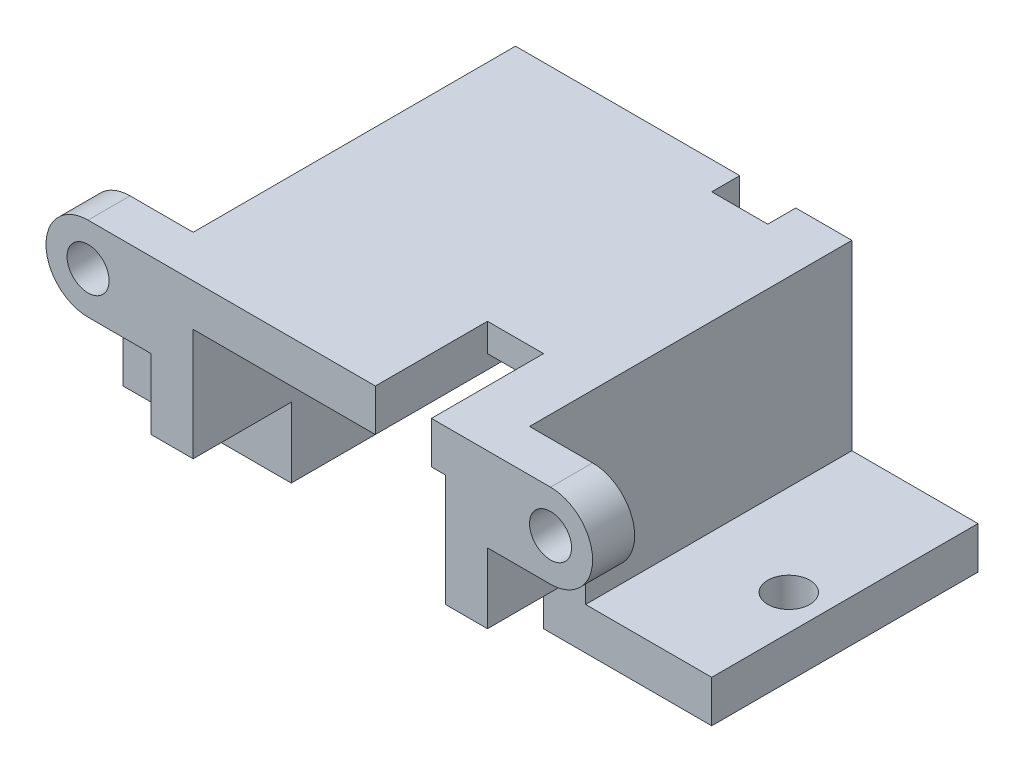
ISO-10303-21;
HEADER;
FILE_DESCRIPTION(('STEP AP214'),'2;1');
FILE_NAME('part.step','',(''),(''),'','','');
FILE_SCHEMA(('AUTOMOTIVE_DESIGN { 1 0 10303 214 1 1 1 1 }'));
ENDSEC;
DATA;
#1=APPLICATION_CONTEXT('core data for automotive mechanical design processes');
#2=APPLICATION_PROTOCOL_DEFINITION('international standard','automotive_design',2000,#1);
#3=PRODUCT_CONTEXT('',#1,'mechanical');
#4=PRODUCT('Part','Part','',(#3));
#5=PRODUCT_RELATED_PRODUCT_CATEGORY('part','',(#4));
#6=PRODUCT_DEFINITION_FORMATION('','',#4);
#7=PRODUCT_DEFINITION_CONTEXT('part definition',#1,'design');
#8=PRODUCT_DEFINITION('design','',#6,#7);
#9=PRODUCT_DEFINITION_SHAPE('','',#8);
#10=(LENGTH_UNIT() NAMED_UNIT(*) SI_UNIT(.MILLI.,.METRE.));
#11=(NAMED_UNIT(*) PLANE_ANGLE_UNIT() SI_UNIT($,.RADIAN.));
#12=(NAMED_UNIT(*) SI_UNIT($,.STERADIAN.) SOLID_ANGLE_UNIT());
#13=UNCERTAINTY_MEASURE_WITH_UNIT(LENGTH_MEASURE(1.E-05),#10,'distance_accuracy_value','');
#14=(GEOMETRIC_REPRESENTATION_CONTEXT(3) GLOBAL_UNCERTAINTY_ASSIGNED_CONTEXT((#13)) GLOBAL_UNIT_ASSIGNED_CONTEXT((#10,
#11,#12)) REPRESENTATION_CONTEXT('',''));
#15=CARTESIAN_POINT('',(0.,0.,0.));
#16=DIRECTION('',(0.,0.,1.));
#17=DIRECTION('',(1.,0.,0.));
#18=AXIS2_PLACEMENT_3D('',#15,#16,#17);
#19=CARTESIAN_POINT('',(-9.,13.,13.));
#20=DIRECTION('',(0.,1.,0.));
#21=DIRECTION('',(0.,0.,1.));
#22=AXIS2_PLACEMENT_3D('',#19,#20,#21);
#23=PLANE('',#22);
#24=DIRECTION('',(0.,0.,1.));
#25=VECTOR('',#24,1.);
#26=CARTESIAN_POINT('',(8.,13.,13.));
#27=LINE('',#26,#25);
#28=CARTESIAN_POINT('',(8.,13.,-13.));
#29=VERTEX_POINT('',#28);
#30=CARTESIAN_POINT('',(8.,13.,13.));
#31=VERTEX_POINT('',#30);
#32=EDGE_CURVE('E478',#29,#31,#27,.T.);
#33=ORIENTED_EDGE('',*,*,#32,.F.);
#34=DIRECTION('',(1.,0.,0.));
#35=VECTOR('',#34,1.);
#36=CARTESIAN_POINT('',(-9.,13.,-13.));
#37=LINE('',#36,#35);
#38=CARTESIAN_POINT('',(9.,13.,-13.));
#39=VERTEX_POINT('',#38);
#40=EDGE_CURVE('E370',#29,#39,#37,.T.);
#41=ORIENTED_EDGE('',*,*,#40,.T.);
#42=DIRECTION('',(0.,0.,-1.));
#43=VECTOR('',#42,1.);
#44=CARTESIAN_POINT('',(9.,13.,13.));
#45=LINE('',#44,#43);
#46=CARTESIAN_POINT('',(9.,13.,13.));
#47=VERTEX_POINT('',#46);
#48=EDGE_CURVE('E377',#47,#39,#45,.T.);
#49=ORIENTED_EDGE('',*,*,#48,.F.);
#50=DIRECTION('',(1.,0.,0.));
#51=VECTOR('',#50,1.);
#52=CARTESIAN_POINT('',(-9.,13.,13.));
#53=LINE('',#52,#51);
#54=EDGE_CURVE('E333',#31,#47,#53,.T.);
#55=ORIENTED_EDGE('',*,*,#54,.F.);
#56=EDGE_LOOP('',(#33,#41,#49,#55));
#57=FACE_BOUND('',#56,.T.);
#58=ADVANCED_FACE('F34',(#57),#23,.F.);
#59=CARTESIAN_POINT('',(-21.,3.,13.));
#60=DIRECTION('',(0.,1.,0.));
#61=DIRECTION('',(0.,0.,1.));
#62=AXIS2_PLACEMENT_3D('',#59,#60,#61);
#63=PLANE('',#62);
#64=DIRECTION('',(-1.,0.,0.));
#65=VECTOR('',#64,1.);
#66=CARTESIAN_POINT('',(-21.,3.,6.));
#67=LINE('',#66,#65);
#68=CARTESIAN_POINT('',(-12.,3.,6.));
#69=VERTEX_POINT('',#68);
#70=CARTESIAN_POINT('',(-21.,3.,6.));
#71=VERTEX_POINT('',#70);
#72=EDGE_CURVE('E452',#69,#71,#67,.T.);
#73=ORIENTED_EDGE('',*,*,#72,.F.);
#74=DIRECTION('',(0.,0.,-1.));
#75=VECTOR('',#74,1.);
#76=CARTESIAN_POINT('',(-12.,3.,13.));
#77=LINE('',#76,#75);
#78=CARTESIAN_POINT('',(-12.,3.,-13.));
#79=VERTEX_POINT('',#78);
#80=EDGE_CURVE('E389',#69,#79,#77,.T.);
#81=ORIENTED_EDGE('',*,*,#80,.T.);
#82=DIRECTION('',(1.,0.,0.));
#83=VECTOR('',#82,1.);
#84=CARTESIAN_POINT('',(-21.,3.,-13.));
#85=LINE('',#84,#83);
#86=CARTESIAN_POINT('',(-21.,3.,-13.));
#87=VERTEX_POINT('',#86);
#88=EDGE_CURVE('E359',#87,#79,#85,.T.);
#89=ORIENTED_EDGE('',*,*,#88,.F.);
#90=DIRECTION('',(0.,0.,-1.));
#91=VECTOR('',#90,1.);
#92=CARTESIAN_POINT('',(-21.,3.,13.));
#93=LINE('',#92,#91);
#94=EDGE_CURVE('E387',#71,#87,#93,.T.);
#95=ORIENTED_EDGE('',*,*,#94,.F.);
#96=EDGE_LOOP('',(#73,#81,#89,#95));
#97=FACE_BOUND('',#96,.T.);
#98=CARTESIAN_POINT('',(-18.5,3.,-2.));
#99=DIRECTION('',(0.,-1.,0.));
#100=DIRECTION('',(0.,0.,1.));
#101=AXIS2_PLACEMENT_3D('',#98,#99,#100);
#102=CIRCLE('',#101,1.5);
#103=CARTESIAN_POINT('',(-18.5,3.,-0.499999999999999));
#104=VERTEX_POINT('',#103);
#105=EDGE_CURVE('E564',#104,#104,#102,.T.);
#106=ORIENTED_EDGE('',*,*,#105,.T.);
#107=EDGE_LOOP('',(#106));
#108=FACE_BOUND('',#107,.T.);
#109=ADVANCED_FACE('F525',(#97,#108),#63,.T.);
#110=CARTESIAN_POINT('',(-21.,0.,13.));
#111=DIRECTION('',(0.,1.,0.));
#112=DIRECTION('',(0.,0.,1.));
#113=AXIS2_PLACEMENT_3D('',#110,#111,#112);
#114=PLANE('',#113);
#115=DIRECTION('',(0.,0.,-1.));
#116=VECTOR('',#115,1.);
#117=CARTESIAN_POINT('',(-9.,0.,13.));
#118=LINE('',#117,#116);
#119=CARTESIAN_POINT('',(-9.,0.,6.));
#120=VERTEX_POINT('',#119);
#121=CARTESIAN_POINT('',(-9.,0.,-13.));
#122=VERTEX_POINT('',#121);
#123=EDGE_CURVE('E383',#120,#122,#118,.T.);
#124=ORIENTED_EDGE('',*,*,#123,.F.);
#125=DIRECTION('',(1.,0.,0.));
#126=VECTOR('',#125,1.);
#127=CARTESIAN_POINT('',(-29.6023252670426,0.,6.));
#128=LINE('',#127,#126);
#129=CARTESIAN_POINT('',(-21.,0.,6.));
#130=VERTEX_POINT('',#129);
#131=EDGE_CURVE('E431',#130,#120,#128,.T.);
#132=ORIENTED_EDGE('',*,*,#131,.F.);
#133=DIRECTION('',(0.,0.,-1.));
#134=VECTOR('',#133,1.);
#135=CARTESIAN_POINT('',(-21.,0.,13.));
#136=LINE('',#135,#134);
#137=CARTESIAN_POINT('',(-21.,0.,-13.));
#138=VERTEX_POINT('',#137);
#139=EDGE_CURVE('E385',#130,#138,#136,.T.);
#140=ORIENTED_EDGE('',*,*,#139,.T.);
#141=DIRECTION('',(1.,0.,0.));
#142=VECTOR('',#141,1.);
#143=CARTESIAN_POINT('',(-21.,0.,-13.));
#144=LINE('',#143,#142);
#145=EDGE_CURVE('E365',#138,#122,#144,.T.);
#146=ORIENTED_EDGE('',*,*,#145,.T.);
#147=EDGE_LOOP('',(#124,#132,#140,#146));
#148=FACE_BOUND('',#147,.T.);
#149=CARTESIAN_POINT('',(-18.5,0.,-2.));
#150=DIRECTION('',(0.,1.,0.));
#151=DIRECTION('',(0.,0.,1.));
#152=AXIS2_PLACEMENT_3D('',#149,#150,#151);
#153=CIRCLE('',#152,1.5);
#154=CARTESIAN_POINT('',(-18.5,0.,-0.499999999999999));
#155=VERTEX_POINT('',#154);
#156=EDGE_CURVE('E561',#155,#155,#153,.T.);
#157=ORIENTED_EDGE('',*,*,#156,.T.);
#158=EDGE_LOOP('',(#157));
#159=FACE_BOUND('',#158,.T.);
#160=ADVANCED_FACE('F531',(#148,#159),#114,.F.);
#161=CARTESIAN_POINT('',(21.,0.,-13.));
#162=DIRECTION('',(0.,0.,-1.));
#163=DIRECTION('',(-1.,0.,0.));
#164=AXIS2_PLACEMENT_3D('',#161,#162,#163);
#165=PLANE('',#164);
#166=DIRECTION('',(0.,1.,0.));
#167=VECTOR('',#166,1.);
#168=CARTESIAN_POINT('',(4.,-0.001000000000001,-13.));
#169=LINE('',#168,#167);
#170=CARTESIAN_POINT('',(4.,13.,-13.));
#171=VERTEX_POINT('',#170);
#172=CARTESIAN_POINT('',(4.,16.,-13.));
#173=VERTEX_POINT('',#172);
#174=EDGE_CURVE('E469',#171,#173,#169,.T.);
#175=ORIENTED_EDGE('',*,*,#174,.F.);
#176=CARTESIAN_POINT('',(-9.,13.,-13.));
#177=VERTEX_POINT('',#176);
#178=EDGE_CURVE('E371',#177,#171,#37,.T.);
#179=ORIENTED_EDGE('',*,*,#178,.F.);
#180=DIRECTION('',(0.,1.,0.));
#181=VECTOR('',#180,1.);
#182=CARTESIAN_POINT('',(-9.,0.,-13.));
#183=LINE('',#182,#181);
#184=EDGE_CURVE('E368',#122,#177,#183,.T.);
#185=ORIENTED_EDGE('',*,*,#184,.F.);
#186=ORIENTED_EDGE('',*,*,#145,.F.);
#187=DIRECTION('',(0.,1.,0.));
#188=VECTOR('',#187,1.);
#189=CARTESIAN_POINT('',(-21.,0.,-13.));
#190=LINE('',#189,#188);
#191=EDGE_CURVE('E362',#138,#87,#190,.T.);
#192=ORIENTED_EDGE('',*,*,#191,.T.);
#193=ORIENTED_EDGE('',*,*,#88,.T.);
#194=DIRECTION('',(0.,1.,0.));
#195=VECTOR('',#194,1.);
#196=CARTESIAN_POINT('',(-12.,0.,-13.));
#197=LINE('',#196,#195);
#198=CARTESIAN_POINT('',(-12.,16.,-13.));
#199=VERTEX_POINT('',#198);
#200=EDGE_CURVE('E356',#79,#199,#197,.T.);
#201=ORIENTED_EDGE('',*,*,#200,.T.);
#202=DIRECTION('',(1.,0.,0.));
#203=VECTOR('',#202,1.);
#204=CARTESIAN_POINT('',(-9.,16.,-13.));
#205=LINE('',#204,#203);
#206=EDGE_CURVE('E353',#199,#173,#205,.T.);
#207=ORIENTED_EDGE('',*,*,#206,.T.);
#208=EDGE_LOOP('',(#175,#179,#185,#186,#192,#193,#201,#207));
#209=FACE_BOUND('',#208,.T.);
#210=ADVANCED_FACE('F550',(#209),#165,.T.);
#211=CARTESIAN_POINT('',(21.,0.,13.));
#212=DIRECTION('',(0.,0.,-1.));
#213=DIRECTION('',(-1.,0.,0.));
#214=AXIS2_PLACEMENT_3D('',#211,#212,#213);
#215=PLANE('',#214);
#216=CARTESIAN_POINT('',(16.5,13.,13.));
#217=DIRECTION('',(0.,0.,-1.));
#218=DIRECTION('',(-1.,0.,0.));
#219=AXIS2_PLACEMENT_3D('',#216,#217,#218);
#220=CIRCLE('',#219,1.5);
#221=CARTESIAN_POINT('',(15.,13.,13.));
#222=VERTEX_POINT('',#221);
#223=EDGE_CURVE('E258',#222,#222,#220,.T.);
#224=ORIENTED_EDGE('',*,*,#223,.T.);
#225=EDGE_LOOP('',(#224));
#226=FACE_BOUND('',#225,.T.);
#227=DIRECTION('',(0.,-1.,0.));
#228=VECTOR('',#227,1.);
#229=CARTESIAN_POINT('',(9.,13.,13.));
#230=LINE('',#229,#228);
#231=CARTESIAN_POINT('',(9.,5.,13.));
#232=VERTEX_POINT('',#231);
#233=EDGE_CURVE('E337',#47,#232,#230,.T.);
#234=ORIENTED_EDGE('',*,*,#233,.T.);
#235=DIRECTION('',(1.,0.,0.));
#236=VECTOR('',#235,1.);
#237=CARTESIAN_POINT('',(-29.6023252670426,5.,13.));
#238=LINE('',#237,#236);
#239=CARTESIAN_POINT('',(12.,5.,13.));
#240=VERTEX_POINT('',#239);
#241=EDGE_CURVE('E412',#232,#240,#238,.T.);
#242=ORIENTED_EDGE('',*,*,#241,.T.);
#243=DIRECTION('',(0.,-1.,0.));
#244=VECTOR('',#243,1.);
#245=CARTESIAN_POINT('',(12.,13.,13.));
#246=LINE('',#245,#244);
#247=CARTESIAN_POINT('',(12.,10.,13.));
#248=VERTEX_POINT('',#247);
#249=EDGE_CURVE('E321',#248,#240,#246,.T.);
#250=ORIENTED_EDGE('',*,*,#249,.F.);
#251=DIRECTION('',(-1.,0.,0.));
#252=VECTOR('',#251,1.);
#253=CARTESIAN_POINT('',(16.5,10.,13.));
#254=LINE('',#253,#252);
#255=CARTESIAN_POINT('',(16.5,10.,13.));
#256=VERTEX_POINT('',#255);
#257=EDGE_CURVE('E265',#256,#248,#254,.T.);
#258=ORIENTED_EDGE('',*,*,#257,.F.);
#259=CARTESIAN_POINT('',(16.5,13.,13.));
#260=DIRECTION('',(0.,0.,-1.));
#261=DIRECTION('',(1.,0.,0.));
#262=AXIS2_PLACEMENT_3D('',#259,#260,#261);
#263=CIRCLE('',#262,3.);
#264=CARTESIAN_POINT('',(16.5,16.,13.));
#265=VERTEX_POINT('',#264);
#266=EDGE_CURVE('E270',#265,#256,#263,.T.);
#267=ORIENTED_EDGE('',*,*,#266,.F.);
#268=DIRECTION('',(1.,0.,0.));
#269=VECTOR('',#268,1.);
#270=CARTESIAN_POINT('',(-9.,16.,13.));
#271=LINE('',#270,#269);
#272=CARTESIAN_POINT('',(8.,16.,13.));
#273=VERTEX_POINT('',#272);
#274=EDGE_CURVE('E324',#273,#265,#271,.T.);
#275=ORIENTED_EDGE('',*,*,#274,.F.);
#276=DIRECTION('',(0.,1.,0.));
#277=VECTOR('',#276,1.);
#278=CARTESIAN_POINT('',(8.,-0.001000000000001,13.));
#279=LINE('',#278,#277);
#280=EDGE_CURVE('E262',#31,#273,#279,.T.);
#281=ORIENTED_EDGE('',*,*,#280,.F.);
#282=ORIENTED_EDGE('',*,*,#54,.T.);
#283=EDGE_LOOP('',(#234,#242,#250,#258,#267,#275,#281,#282));
#284=FACE_BOUND('',#283,.T.);
#285=ADVANCED_FACE('F411',(#226,#284),#215,.F.);
#286=DIRECTION('',(0.,1.,0.));
#287=VECTOR('',#286,1.);
#288=CARTESIAN_POINT('',(-12.,0.,13.));
#289=LINE('',#288,#287);
#290=CARTESIAN_POINT('',(-12.,5.,13.));
#291=VERTEX_POINT('',#290);
#292=CARTESIAN_POINT('',(-12.,10.,13.));
#293=VERTEX_POINT('',#292);
#294=EDGE_CURVE('E329',#291,#293,#289,.T.);
#295=ORIENTED_EDGE('',*,*,#294,.F.);
#296=CARTESIAN_POINT('',(-9.,5.,13.));
#297=VERTEX_POINT('',#296);
#298=EDGE_CURVE('E445',#291,#297,#238,.T.);
#299=ORIENTED_EDGE('',*,*,#298,.T.);
#300=DIRECTION('',(0.,1.,0.));
#301=VECTOR('',#300,1.);
#302=CARTESIAN_POINT('',(-9.,0.,13.));
#303=LINE('',#302,#301);
#304=CARTESIAN_POINT('',(-9.,13.,13.));
#305=VERTEX_POINT('',#304);
#306=EDGE_CURVE('E331',#297,#305,#303,.T.);
#307=ORIENTED_EDGE('',*,*,#306,.T.);
#308=CARTESIAN_POINT('',(4.,13.,13.));
#309=VERTEX_POINT('',#308);
#310=EDGE_CURVE('E334',#305,#309,#53,.T.);
#311=ORIENTED_EDGE('',*,*,#310,.T.);
#312=DIRECTION('',(0.,1.,0.));
#313=VECTOR('',#312,1.);
#314=CARTESIAN_POINT('',(4.,-0.001000000000001,13.));
#315=LINE('',#314,#313);
#316=CARTESIAN_POINT('',(4.,16.,13.));
#317=VERTEX_POINT('',#316);
#318=EDGE_CURVE('E252',#309,#317,#315,.T.);
#319=ORIENTED_EDGE('',*,*,#318,.T.);
#320=CARTESIAN_POINT('',(-16.5,16.,13.));
#321=VERTEX_POINT('',#320);
#322=EDGE_CURVE('E326',#321,#317,#271,.T.);
#323=ORIENTED_EDGE('',*,*,#322,.F.);
#324=CARTESIAN_POINT('',(-16.5,13.,13.));
#325=DIRECTION('',(0.,0.,1.));
#326=DIRECTION('',(-1.,0.,0.));
#327=AXIS2_PLACEMENT_3D('',#324,#325,#326);
#328=CIRCLE('',#327,3.);
#329=CARTESIAN_POINT('',(-16.5,10.,13.));
#330=VERTEX_POINT('',#329);
#331=EDGE_CURVE('E293',#321,#330,#328,.T.);
#332=ORIENTED_EDGE('',*,*,#331,.T.);
#333=DIRECTION('',(1.,0.,0.));
#334=VECTOR('',#333,1.);
#335=CARTESIAN_POINT('',(-16.5,10.,13.));
#336=LINE('',#335,#334);
#337=EDGE_CURVE('E299',#330,#293,#336,.T.);
#338=ORIENTED_EDGE('',*,*,#337,.T.);
#339=EDGE_LOOP('',(#295,#299,#307,#311,#319,#323,#332,#338));
#340=FACE_BOUND('',#339,.T.);
#341=CARTESIAN_POINT('',(-16.5,13.,13.));
#342=DIRECTION('',(0.,0.,1.));
#343=DIRECTION('',(1.,0.,0.));
#344=AXIS2_PLACEMENT_3D('',#341,#342,#343);
#345=CIRCLE('',#344,1.5);
#346=CARTESIAN_POINT('',(-15.,13.,13.));
#347=VERTEX_POINT('',#346);
#348=EDGE_CURVE('E290',#347,#347,#345,.T.);
#349=ORIENTED_EDGE('',*,*,#348,.F.);
#350=EDGE_LOOP('',(#349));
#351=FACE_BOUND('',#350,.T.);
#352=ADVANCED_FACE('F485',(#340,#351),#215,.F.);
#353=CARTESIAN_POINT('',(16.5,13.,10.));
#354=DIRECTION('',(0.,0.,-1.));
#355=DIRECTION('',(1.,0.,0.));
#356=AXIS2_PLACEMENT_3D('',#353,#354,#355);
#357=PLANE('',#356);
#358=DIRECTION('',(0.,1.,0.));
#359=VECTOR('',#358,1.);
#360=CARTESIAN_POINT('',(12.,10.,10.));
#361=LINE('',#360,#359);
#362=CARTESIAN_POINT('',(12.,10.,10.));
#363=VERTEX_POINT('',#362);
#364=CARTESIAN_POINT('',(12.,16.,10.));
#365=VERTEX_POINT('',#364);
#366=EDGE_CURVE('E266',#363,#365,#361,.T.);
#367=ORIENTED_EDGE('',*,*,#366,.T.);
#368=DIRECTION('',(1.,0.,0.));
#369=VECTOR('',#368,1.);
#370=CARTESIAN_POINT('',(12.,16.,10.));
#371=LINE('',#370,#369);
#372=CARTESIAN_POINT('',(16.5,16.,10.));
#373=VERTEX_POINT('',#372);
#374=EDGE_CURVE('E275',#365,#373,#371,.T.);
#375=ORIENTED_EDGE('',*,*,#374,.T.);
#376=CARTESIAN_POINT('',(16.5,13.,10.));
#377=DIRECTION('',(0.,0.,-1.));
#378=DIRECTION('',(1.,0.,0.));
#379=AXIS2_PLACEMENT_3D('',#376,#377,#378);
#380=CIRCLE('',#379,3.);
#381=CARTESIAN_POINT('',(16.5,10.,10.));
#382=VERTEX_POINT('',#381);
#383=EDGE_CURVE('E273',#373,#382,#380,.T.);
#384=ORIENTED_EDGE('',*,*,#383,.T.);
#385=DIRECTION('',(-1.,0.,0.));
#386=VECTOR('',#385,1.);
#387=CARTESIAN_POINT('',(16.5,10.,10.));
#388=LINE('',#387,#386);
#389=EDGE_CURVE('E269',#382,#363,#388,.T.);
#390=ORIENTED_EDGE('',*,*,#389,.T.);
#391=EDGE_LOOP('',(#367,#375,#384,#390));
#392=FACE_BOUND('',#391,.T.);
#393=CARTESIAN_POINT('',(16.5,13.,10.));
#394=DIRECTION('',(0.,0.,-1.));
#395=DIRECTION('',(-1.,0.,0.));
#396=AXIS2_PLACEMENT_3D('',#393,#394,#395);
#397=CIRCLE('',#396,1.5);
#398=CARTESIAN_POINT('',(15.,13.,10.));
#399=VERTEX_POINT('',#398);
#400=EDGE_CURVE('E261',#399,#399,#397,.T.);
#401=ORIENTED_EDGE('',*,*,#400,.F.);
#402=EDGE_LOOP('',(#401));
#403=FACE_BOUND('',#402,.T.);
#404=ADVANCED_FACE('F595',(#392,#403),#357,.T.);
#405=CARTESIAN_POINT('',(12.,13.,13.));
#406=DIRECTION('',(1.,0.,0.));
#407=DIRECTION('',(0.,1.,0.));
#408=AXIS2_PLACEMENT_3D('',#405,#406,#407);
#409=PLANE('',#408);
#410=DIRECTION('',(0.,1.,0.));
#411=VECTOR('',#410,1.);
#412=CARTESIAN_POINT('',(12.,13.,6.));
#413=LINE('',#412,#411);
#414=CARTESIAN_POINT('',(12.,3.,6.));
#415=VERTEX_POINT('',#414);
#416=CARTESIAN_POINT('',(12.,5.,6.));
#417=VERTEX_POINT('',#416);
#418=EDGE_CURVE('E458',#415,#417,#413,.T.);
#419=ORIENTED_EDGE('',*,*,#418,.F.);
#420=DIRECTION('',(0.,0.,-1.));
#421=VECTOR('',#420,1.);
#422=CARTESIAN_POINT('',(12.,3.,13.));
#423=LINE('',#422,#421);
#424=CARTESIAN_POINT('',(12.,3.,-13.));
#425=VERTEX_POINT('',#424);
#426=EDGE_CURVE('E396',#415,#425,#423,.T.);
#427=ORIENTED_EDGE('',*,*,#426,.T.);
#428=DIRECTION('',(0.,-1.,0.));
#429=VECTOR('',#428,1.);
#430=CARTESIAN_POINT('',(12.,13.,-13.));
#431=LINE('',#430,#429);
#432=CARTESIAN_POINT('',(12.,16.,-13.));
#433=VERTEX_POINT('',#432);
#434=EDGE_CURVE('E349',#433,#425,#431,.T.);
#435=ORIENTED_EDGE('',*,*,#434,.F.);
#436=DIRECTION('',(0.,0.,-1.));
#437=VECTOR('',#436,1.);
#438=CARTESIAN_POINT('',(12.,16.,13.));
#439=LINE('',#438,#437);
#440=EDGE_CURVE('E393',#365,#433,#439,.T.);
#441=ORIENTED_EDGE('',*,*,#440,.F.);
#442=ORIENTED_EDGE('',*,*,#366,.F.);
#443=DIRECTION('',(0.,0.,1.));
#444=VECTOR('',#443,1.);
#445=CARTESIAN_POINT('',(12.,10.,10.));
#446=LINE('',#445,#444);
#447=EDGE_CURVE('E277',#363,#248,#446,.T.);
#448=ORIENTED_EDGE('',*,*,#447,.T.);
#449=ORIENTED_EDGE('',*,*,#249,.T.);
#450=DIRECTION('',(0.,0.,1.));
#451=VECTOR('',#450,1.);
#452=CARTESIAN_POINT('',(12.,5.,13.));
#453=LINE('',#452,#451);
#454=EDGE_CURVE('E447',#417,#240,#453,.T.);
#455=ORIENTED_EDGE('',*,*,#454,.F.);
#456=EDGE_LOOP('',(#419,#427,#435,#441,#442,#448,#449,#455));
#457=FACE_BOUND('',#456,.T.);
#458=ADVANCED_FACE('F580',(#457),#409,.T.);
#459=CARTESIAN_POINT('',(9.,0.,13.));
#460=DIRECTION('',(0.,1.,0.));
#461=DIRECTION('',(0.,0.,1.));
#462=AXIS2_PLACEMENT_3D('',#459,#460,#461);
#463=PLANE('',#462);
#464=CARTESIAN_POINT('',(18.5,0.,-2.));
#465=DIRECTION('',(0.,1.,0.));
#466=DIRECTION('',(0.,0.,1.));
#467=AXIS2_PLACEMENT_3D('',#464,#465,#466);
#468=CIRCLE('',#467,1.5);
#469=CARTESIAN_POINT('',(18.5,0.,-0.499999999999999));
#470=VERTEX_POINT('',#469);
#471=EDGE_CURVE('E435',#470,#470,#468,.F.);
#472=ORIENTED_EDGE('',*,*,#471,.F.);
#473=EDGE_LOOP('',(#472));
#474=FACE_BOUND('',#473,.T.);
#475=DIRECTION('',(0.,0.,-1.));
#476=VECTOR('',#475,1.);
#477=CARTESIAN_POINT('',(21.,0.,13.));
#478=LINE('',#477,#476);
#479=CARTESIAN_POINT('',(21.,0.,6.));
#480=VERTEX_POINT('',#479);
#481=CARTESIAN_POINT('',(21.,0.,-13.));
#482=VERTEX_POINT('',#481);
#483=EDGE_CURVE('E400',#480,#482,#478,.T.);
#484=ORIENTED_EDGE('',*,*,#483,.F.);
#485=CARTESIAN_POINT('',(9.,0.,6.));
#486=VERTEX_POINT('',#485);
#487=EDGE_CURVE('E428',#486,#480,#128,.T.);
#488=ORIENTED_EDGE('',*,*,#487,.F.);
#489=DIRECTION('',(0.,0.,-1.));
#490=VECTOR('',#489,1.);
#491=CARTESIAN_POINT('',(9.,0.,13.));
#492=LINE('',#491,#490);
#493=CARTESIAN_POINT('',(9.,0.,-13.));
#494=VERTEX_POINT('',#493);
#495=EDGE_CURVE('E340',#486,#494,#492,.T.);
#496=ORIENTED_EDGE('',*,*,#495,.T.);
#497=DIRECTION('',(1.,0.,0.));
#498=VECTOR('',#497,1.);
#499=CARTESIAN_POINT('',(9.,0.,-13.));
#500=LINE('',#499,#498);
#501=EDGE_CURVE('E316',#494,#482,#500,.T.);
#502=ORIENTED_EDGE('',*,*,#501,.T.);
#503=EDGE_LOOP('',(#484,#488,#496,#502));
#504=FACE_BOUND('',#503,.T.);
#505=ADVANCED_FACE('F36',(#474,#504),#463,.F.);
#506=CARTESIAN_POINT('',(21.,3.,13.));
#507=DIRECTION('',(1.,0.,0.));
#508=DIRECTION('',(0.,0.,-1.));
#509=AXIS2_PLACEMENT_3D('',#506,#507,#508);
#510=PLANE('',#509);
#511=DIRECTION('',(0.,1.,0.));
#512=VECTOR('',#511,1.);
#513=CARTESIAN_POINT('',(21.,0.,6.));
#514=LINE('',#513,#512);
#515=CARTESIAN_POINT('',(21.,3.,6.));
#516=VERTEX_POINT('',#515);
#517=EDGE_CURVE('E432',#480,#516,#514,.T.);
#518=ORIENTED_EDGE('',*,*,#517,.F.);
#519=ORIENTED_EDGE('',*,*,#483,.T.);
#520=DIRECTION('',(0.,-1.,0.));
#521=VECTOR('',#520,1.);
#522=CARTESIAN_POINT('',(21.,3.,-13.));
#523=LINE('',#522,#521);
#524=CARTESIAN_POINT('',(21.,3.,-13.));
#525=VERTEX_POINT('',#524);
#526=EDGE_CURVE('E343',#525,#482,#523,.T.);
#527=ORIENTED_EDGE('',*,*,#526,.F.);
#528=DIRECTION('',(0.,0.,-1.));
#529=VECTOR('',#528,1.);
#530=CARTESIAN_POINT('',(21.,3.,13.));
#531=LINE('',#530,#529);
#532=EDGE_CURVE('E398',#516,#525,#531,.T.);
#533=ORIENTED_EDGE('',*,*,#532,.F.);
#534=EDGE_LOOP('',(#518,#519,#527,#533));
#535=FACE_BOUND('',#534,.T.);
#536=ADVANCED_FACE('F604',(#535),#510,.T.);
#537=CARTESIAN_POINT('',(9.,3.,13.));
#538=DIRECTION('',(0.,1.,0.));
#539=DIRECTION('',(0.,0.,1.));
#540=AXIS2_PLACEMENT_3D('',#537,#538,#539);
#541=PLANE('',#540);
#542=CARTESIAN_POINT('',(18.5,3.,-2.));
#543=DIRECTION('',(0.,1.,0.));
#544=DIRECTION('',(0.,0.,1.));
#545=AXIS2_PLACEMENT_3D('',#542,#543,#544);
#546=CIRCLE('',#545,1.5);
#547=CARTESIAN_POINT('',(18.5,3.,-0.499999999999999));
#548=VERTEX_POINT('',#547);
#549=EDGE_CURVE('E567',#548,#548,#546,.T.);
#550=ORIENTED_EDGE('',*,*,#549,.F.);
#551=EDGE_LOOP('',(#550));
#552=FACE_BOUND('',#551,.T.);
#553=DIRECTION('',(-1.,0.,0.));
#554=VECTOR('',#553,1.);
#555=CARTESIAN_POINT('',(9.,3.,6.));
#556=LINE('',#555,#554);
#557=EDGE_CURVE('E456',#516,#415,#556,.T.);
#558=ORIENTED_EDGE('',*,*,#557,.F.);
#559=ORIENTED_EDGE('',*,*,#532,.T.);
#560=DIRECTION('',(1.,0.,0.));
#561=VECTOR('',#560,1.);
#562=CARTESIAN_POINT('',(9.,3.,-13.));
#563=LINE('',#562,#561);
#564=EDGE_CURVE('E346',#425,#525,#563,.T.);
#565=ORIENTED_EDGE('',*,*,#564,.F.);
#566=ORIENTED_EDGE('',*,*,#426,.F.);
#567=EDGE_LOOP('',(#558,#559,#565,#566));
#568=FACE_BOUND('',#567,.T.);
#569=ADVANCED_FACE('F601',(#552,#568),#541,.T.);
#570=CARTESIAN_POINT('',(-9.,16.,13.));
#571=DIRECTION('',(0.,1.,0.));
#572=DIRECTION('',(0.,0.,1.));
#573=AXIS2_PLACEMENT_3D('',#570,#571,#572);
#574=PLANE('',#573);
#575=DIRECTION('',(0.,0.,1.));
#576=VECTOR('',#575,1.);
#577=CARTESIAN_POINT('',(4.,16.,-13.));
#578=LINE('',#577,#576);
#579=CARTESIAN_POINT('',(4.,16.,-11.));
#580=VERTEX_POINT('',#579);
#581=EDGE_CURVE('E460',#173,#580,#578,.T.);
#582=ORIENTED_EDGE('',*,*,#581,.F.);
#583=ORIENTED_EDGE('',*,*,#206,.F.);
#584=DIRECTION('',(0.,0.,-1.));
#585=VECTOR('',#584,1.);
#586=CARTESIAN_POINT('',(-12.,16.,13.));
#587=LINE('',#586,#585);
#588=CARTESIAN_POINT('',(-12.,16.,10.));
#589=VERTEX_POINT('',#588);
#590=EDGE_CURVE('E391',#589,#199,#587,.T.);
#591=ORIENTED_EDGE('',*,*,#590,.F.);
#592=DIRECTION('',(-1.,0.,0.));
#593=VECTOR('',#592,1.);
#594=CARTESIAN_POINT('',(-12.,16.,10.));
#595=LINE('',#594,#593);
#596=CARTESIAN_POINT('',(-16.5,16.,10.));
#597=VERTEX_POINT('',#596);
#598=EDGE_CURVE('E298',#589,#597,#595,.T.);
#599=ORIENTED_EDGE('',*,*,#598,.T.);
#600=DIRECTION('',(0.,0.,1.));
#601=VECTOR('',#600,1.);
#602=CARTESIAN_POINT('',(-16.5,16.,10.));
#603=LINE('',#602,#601);
#604=EDGE_CURVE('E308',#597,#321,#603,.T.);
#605=ORIENTED_EDGE('',*,*,#604,.T.);
#606=ORIENTED_EDGE('',*,*,#322,.T.);
#607=DIRECTION('',(0.,0.,1.));
#608=VECTOR('',#607,1.);
#609=CARTESIAN_POINT('',(4.,16.,13.));
#610=LINE('',#609,#608);
#611=CARTESIAN_POINT('',(4.,16.,5.));
#612=VERTEX_POINT('',#611);
#613=EDGE_CURVE('E250',#612,#317,#610,.T.);
#614=ORIENTED_EDGE('',*,*,#613,.F.);
#615=DIRECTION('',(-1.,0.,0.));
#616=VECTOR('',#615,1.);
#617=CARTESIAN_POINT('',(8.,16.,5.));
#618=LINE('',#617,#616);
#619=CARTESIAN_POINT('',(8.,16.,5.));
#620=VERTEX_POINT('',#619);
#621=EDGE_CURVE('E254',#620,#612,#618,.T.);
#622=ORIENTED_EDGE('',*,*,#621,.F.);
#623=DIRECTION('',(0.,0.,-1.));
#624=VECTOR('',#623,1.);
#625=CARTESIAN_POINT('',(8.,16.,13.));
#626=LINE('',#625,#624);
#627=EDGE_CURVE('E248',#273,#620,#626,.T.);
#628=ORIENTED_EDGE('',*,*,#627,.F.);
#629=ORIENTED_EDGE('',*,*,#274,.T.);
#630=DIRECTION('',(0.,0.,1.));
#631=VECTOR('',#630,1.);
#632=CARTESIAN_POINT('',(16.5,16.,10.));
#633=LINE('',#632,#631);
#634=EDGE_CURVE('E281',#373,#265,#633,.T.);
#635=ORIENTED_EDGE('',*,*,#634,.F.);
#636=ORIENTED_EDGE('',*,*,#374,.F.);
#637=ORIENTED_EDGE('',*,*,#440,.T.);
#638=CARTESIAN_POINT('',(8.,16.,-13.));
#639=VERTEX_POINT('',#638);
#640=EDGE_CURVE('E352',#639,#433,#205,.T.);
#641=ORIENTED_EDGE('',*,*,#640,.F.);
#642=DIRECTION('',(0.,0.,-1.));
#643=VECTOR('',#642,1.);
#644=CARTESIAN_POINT('',(8.,16.,-13.));
#645=LINE('',#644,#643);
#646=CARTESIAN_POINT('',(8.,16.,-11.));
#647=VERTEX_POINT('',#646);
#648=EDGE_CURVE('E466',#647,#639,#645,.T.);
#649=ORIENTED_EDGE('',*,*,#648,.F.);
#650=DIRECTION('',(1.,0.,0.));
#651=VECTOR('',#650,1.);
#652=CARTESIAN_POINT('',(4.,16.,-11.));
#653=LINE('',#652,#651);
#654=EDGE_CURVE('E463',#580,#647,#653,.T.);
#655=ORIENTED_EDGE('',*,*,#654,.F.);
#656=EDGE_LOOP('',(#582,#583,#591,#599,#605,#606,#614,#622,#628,#629,#635,#636,#637,#641,#649,#655));
#657=FACE_BOUND('',#656,.T.);
#658=ADVANCED_FACE('F493',(#657),#574,.T.);
#659=CARTESIAN_POINT('',(-12.,0.,13.));
#660=DIRECTION('',(-1.,0.,0.));
#661=DIRECTION('',(0.,0.,1.));
#662=AXIS2_PLACEMENT_3D('',#659,#660,#661);
#663=PLANE('',#662);
#664=DIRECTION('',(0.,-1.,0.));
#665=VECTOR('',#664,1.);
#666=CARTESIAN_POINT('',(-12.,0.,6.));
#667=LINE('',#666,#665);
#668=CARTESIAN_POINT('',(-12.,5.,6.));
#669=VERTEX_POINT('',#668);
#670=EDGE_CURVE('E454',#669,#69,#667,.T.);
#671=ORIENTED_EDGE('',*,*,#670,.F.);
#672=DIRECTION('',(0.,0.,-1.));
#673=VECTOR('',#672,1.);
#674=CARTESIAN_POINT('',(-12.,5.,13.));
#675=LINE('',#674,#673);
#676=EDGE_CURVE('E444',#291,#669,#675,.T.);
#677=ORIENTED_EDGE('',*,*,#676,.F.);
#678=ORIENTED_EDGE('',*,*,#294,.T.);
#679=DIRECTION('',(0.,0.,1.));
#680=VECTOR('',#679,1.);
#681=CARTESIAN_POINT('',(-12.,10.,10.));
#682=LINE('',#681,#680);
#683=CARTESIAN_POINT('',(-12.,10.,10.));
#684=VERTEX_POINT('',#683);
#685=EDGE_CURVE('E313',#684,#293,#682,.T.);
#686=ORIENTED_EDGE('',*,*,#685,.F.);
#687=DIRECTION('',(0.,1.,0.));
#688=VECTOR('',#687,1.);
#689=CARTESIAN_POINT('',(-12.,10.,10.));
#690=LINE('',#689,#688);
#691=EDGE_CURVE('E296',#684,#589,#690,.T.);
#692=ORIENTED_EDGE('',*,*,#691,.T.);
#693=ORIENTED_EDGE('',*,*,#590,.T.);
#694=ORIENTED_EDGE('',*,*,#200,.F.);
#695=ORIENTED_EDGE('',*,*,#80,.F.);
#696=EDGE_LOOP('',(#671,#677,#678,#686,#692,#693,#694,#695));
#697=FACE_BOUND('',#696,.T.);
#698=ADVANCED_FACE('F507',(#697),#663,.T.);
#699=CARTESIAN_POINT('',(-21.,0.,13.));
#700=DIRECTION('',(-1.,0.,0.));
#701=DIRECTION('',(0.,0.,1.));
#702=AXIS2_PLACEMENT_3D('',#699,#700,#701);
#703=PLANE('',#702);
#704=DIRECTION('',(0.,1.,0.));
#705=VECTOR('',#704,1.);
#706=CARTESIAN_POINT('',(-21.,0.,6.));
#707=LINE('',#706,#705);
#708=EDGE_CURVE('E434',#130,#71,#707,.T.);
#709=ORIENTED_EDGE('',*,*,#708,.T.);
#710=ORIENTED_EDGE('',*,*,#94,.T.);
#711=ORIENTED_EDGE('',*,*,#191,.F.);
#712=ORIENTED_EDGE('',*,*,#139,.F.);
#713=EDGE_LOOP('',(#709,#710,#711,#712));
#714=FACE_BOUND('',#713,.T.);
#715=ADVANCED_FACE('F543',(#714),#703,.T.);
#716=CARTESIAN_POINT('',(-9.,0.,13.));
#717=DIRECTION('',(-1.,0.,0.));
#718=DIRECTION('',(0.,0.,1.));
#719=AXIS2_PLACEMENT_3D('',#716,#717,#718);
#720=PLANE('',#719);
#721=DIRECTION('',(0.,0.,-1.));
#722=VECTOR('',#721,1.);
#723=CARTESIAN_POINT('',(-9.,5.,13.));
#724=LINE('',#723,#722);
#725=CARTESIAN_POINT('',(-9.,5.,6.));
#726=VERTEX_POINT('',#725);
#727=EDGE_CURVE('E441',#297,#726,#724,.T.);
#728=ORIENTED_EDGE('',*,*,#727,.T.);
#729=DIRECTION('',(0.,-1.,0.));
#730=VECTOR('',#729,1.);
#731=CARTESIAN_POINT('',(-9.,0.,6.));
#732=LINE('',#731,#730);
#733=EDGE_CURVE('E449',#726,#120,#732,.T.);
#734=ORIENTED_EDGE('',*,*,#733,.T.);
#735=ORIENTED_EDGE('',*,*,#123,.T.);
#736=ORIENTED_EDGE('',*,*,#184,.T.);
#737=DIRECTION('',(0.,0.,-1.));
#738=VECTOR('',#737,1.);
#739=CARTESIAN_POINT('',(-9.,13.,13.));
#740=LINE('',#739,#738);
#741=EDGE_CURVE('E380',#305,#177,#740,.T.);
#742=ORIENTED_EDGE('',*,*,#741,.F.);
#743=ORIENTED_EDGE('',*,*,#306,.F.);
#744=EDGE_LOOP('',(#728,#734,#735,#736,#742,#743));
#745=FACE_BOUND('',#744,.T.);
#746=ADVANCED_FACE('F537',(#745),#720,.F.);
#747=ORIENTED_EDGE('',*,*,#178,.T.);
#748=DIRECTION('',(0.,0.,-1.));
#749=VECTOR('',#748,1.);
#750=CARTESIAN_POINT('',(4.,13.,13.));
#751=LINE('',#750,#749);
#752=EDGE_CURVE('E471',#309,#171,#751,.T.);
#753=ORIENTED_EDGE('',*,*,#752,.F.);
#754=ORIENTED_EDGE('',*,*,#310,.F.);
#755=ORIENTED_EDGE('',*,*,#741,.T.);
#756=EDGE_LOOP('',(#747,#753,#754,#755));
#757=FACE_BOUND('',#756,.T.);
#758=ADVANCED_FACE('F527',(#757),#23,.F.);
#759=CARTESIAN_POINT('',(9.,13.,13.));
#760=DIRECTION('',(1.,0.,0.));
#761=DIRECTION('',(0.,1.,0.));
#762=AXIS2_PLACEMENT_3D('',#759,#760,#761);
#763=PLANE('',#762);
#764=ORIENTED_EDGE('',*,*,#495,.F.);
#765=DIRECTION('',(0.,1.,0.));
#766=VECTOR('',#765,1.);
#767=CARTESIAN_POINT('',(9.,13.,6.));
#768=LINE('',#767,#766);
#769=CARTESIAN_POINT('',(9.,5.,6.));
#770=VERTEX_POINT('',#769);
#771=EDGE_CURVE('E11',#486,#770,#768,.T.);
#772=ORIENTED_EDGE('',*,*,#771,.T.);
#773=DIRECTION('',(0.,0.,1.));
#774=VECTOR('',#773,1.);
#775=CARTESIAN_POINT('',(9.,5.,13.));
#776=LINE('',#775,#774);
#777=EDGE_CURVE('E42',#770,#232,#776,.T.);
#778=ORIENTED_EDGE('',*,*,#777,.T.);
#779=ORIENTED_EDGE('',*,*,#233,.F.);
#780=ORIENTED_EDGE('',*,*,#48,.T.);
#781=DIRECTION('',(0.,-1.,0.));
#782=VECTOR('',#781,1.);
#783=CARTESIAN_POINT('',(9.,13.,-13.));
#784=LINE('',#783,#782);
#785=EDGE_CURVE('E325',#39,#494,#784,.T.);
#786=ORIENTED_EDGE('',*,*,#785,.T.);
#787=EDGE_LOOP('',(#764,#772,#778,#779,#780,#786));
#788=FACE_BOUND('',#787,.T.);
#789=ADVANCED_FACE('F405',(#788),#763,.F.);
#790=DIRECTION('',(0.,1.,0.));
#791=VECTOR('',#790,1.);
#792=CARTESIAN_POINT('',(8.,-0.001000000000001,-13.));
#793=LINE('',#792,#791);
#794=EDGE_CURVE('E472',#29,#639,#793,.T.);
#795=ORIENTED_EDGE('',*,*,#794,.T.);
#796=ORIENTED_EDGE('',*,*,#640,.T.);
#797=ORIENTED_EDGE('',*,*,#434,.T.);
#798=ORIENTED_EDGE('',*,*,#564,.T.);
#799=ORIENTED_EDGE('',*,*,#526,.T.);
#800=ORIENTED_EDGE('',*,*,#501,.F.);
#801=ORIENTED_EDGE('',*,*,#785,.F.);
#802=ORIENTED_EDGE('',*,*,#40,.F.);
#803=EDGE_LOOP('',(#795,#796,#797,#798,#799,#800,#801,#802));
#804=FACE_BOUND('',#803,.T.);
#805=ADVANCED_FACE('F423',(#804),#165,.T.);
#806=CARTESIAN_POINT('',(-16.5,10.,10.));
#807=DIRECTION('',(0.,-1.,0.));
#808=DIRECTION('',(0.,0.,-1.));
#809=AXIS2_PLACEMENT_3D('',#806,#807,#808);
#810=PLANE('',#809);
#811=ORIENTED_EDGE('',*,*,#337,.F.);
#812=DIRECTION('',(0.,0.,1.));
#813=VECTOR('',#812,1.);
#814=CARTESIAN_POINT('',(-16.5,10.,10.));
#815=LINE('',#814,#813);
#816=CARTESIAN_POINT('',(-16.5,10.,10.));
#817=VERTEX_POINT('',#816);
#818=EDGE_CURVE('E317',#817,#330,#815,.T.);
#819=ORIENTED_EDGE('',*,*,#818,.F.);
#820=DIRECTION('',(1.,0.,0.));
#821=VECTOR('',#820,1.);
#822=CARTESIAN_POINT('',(-16.5,10.,10.));
#823=LINE('',#822,#821);
#824=EDGE_CURVE('E305',#817,#684,#823,.T.);
#825=ORIENTED_EDGE('',*,*,#824,.T.);
#826=ORIENTED_EDGE('',*,*,#685,.T.);
#827=EDGE_LOOP('',(#811,#819,#825,#826));
#828=FACE_BOUND('',#827,.T.);
#829=ADVANCED_FACE('F502',(#828),#810,.T.);
#830=CARTESIAN_POINT('',(-16.5,13.,10.));
#831=DIRECTION('',(0.,0.,1.));
#832=DIRECTION('',(1.,0.,0.));
#833=AXIS2_PLACEMENT_3D('',#830,#831,#832);
#834=CYLINDRICAL_SURFACE('',#833,3.);
#835=ORIENTED_EDGE('',*,*,#331,.F.);
#836=ORIENTED_EDGE('',*,*,#604,.F.);
#837=CARTESIAN_POINT('',(-16.5,13.,10.));
#838=DIRECTION('',(0.,0.,1.));
#839=DIRECTION('',(-1.,0.,0.));
#840=AXIS2_PLACEMENT_3D('',#837,#838,#839);
#841=CIRCLE('',#840,3.);
#842=EDGE_CURVE('E302',#597,#817,#841,.T.);
#843=ORIENTED_EDGE('',*,*,#842,.T.);
#844=ORIENTED_EDGE('',*,*,#818,.T.);
#845=EDGE_LOOP('',(#835,#836,#843,#844));
#846=FACE_BOUND('',#845,.T.);
#847=ADVANCED_FACE('F499',(#846),#834,.T.);
#848=CARTESIAN_POINT('',(-16.5,13.,10.));
#849=DIRECTION('',(0.,0.,-1.));
#850=DIRECTION('',(-1.,0.,0.));
#851=AXIS2_PLACEMENT_3D('',#848,#849,#850);
#852=PLANE('',#851);
#853=CARTESIAN_POINT('',(-16.5,13.,10.));
#854=DIRECTION('',(0.,0.,-1.));
#855=DIRECTION('',(-1.,0.,0.));
#856=AXIS2_PLACEMENT_3D('',#853,#854,#855);
#857=CIRCLE('',#856,1.5);
#858=CARTESIAN_POINT('',(-18.,13.,10.));
#859=VERTEX_POINT('',#858);
#860=EDGE_CURVE('E284',#859,#859,#857,.F.);
#861=ORIENTED_EDGE('',*,*,#860,.T.);
#862=EDGE_LOOP('',(#861));
#863=FACE_BOUND('',#862,.T.);
#864=ORIENTED_EDGE('',*,*,#691,.F.);
#865=ORIENTED_EDGE('',*,*,#824,.F.);
#866=ORIENTED_EDGE('',*,*,#842,.F.);
#867=ORIENTED_EDGE('',*,*,#598,.F.);
#868=EDGE_LOOP('',(#864,#865,#866,#867));
#869=FACE_BOUND('',#868,.T.);
#870=ADVANCED_FACE('F510',(#863,#869),#852,.T.);
#871=CARTESIAN_POINT('',(-16.5,13.,-13.001));
#872=DIRECTION('',(0.,0.,1.));
#873=DIRECTION('',(1.,0.,0.));
#874=AXIS2_PLACEMENT_3D('',#871,#872,#873);
#875=CYLINDRICAL_SURFACE('',#874,1.5);
#876=ORIENTED_EDGE('',*,*,#860,.F.);
#877=EDGE_LOOP('',(#876));
#878=FACE_BOUND('',#877,.T.);
#879=ORIENTED_EDGE('',*,*,#348,.T.);
#880=EDGE_LOOP('',(#879));
#881=FACE_BOUND('',#880,.T.);
#882=ADVANCED_FACE('F512',(#878,#881),#875,.F.);
#883=CARTESIAN_POINT('',(16.5,13.,10.));
#884=DIRECTION('',(0.,0.,1.));
#885=DIRECTION('',(1.,0.,0.));
#886=AXIS2_PLACEMENT_3D('',#883,#884,#885);
#887=CYLINDRICAL_SURFACE('',#886,3.);
#888=ORIENTED_EDGE('',*,*,#266,.T.);
#889=DIRECTION('',(0.,0.,1.));
#890=VECTOR('',#889,1.);
#891=CARTESIAN_POINT('',(16.5,10.,10.));
#892=LINE('',#891,#890);
#893=EDGE_CURVE('E285',#382,#256,#892,.T.);
#894=ORIENTED_EDGE('',*,*,#893,.F.);
#895=ORIENTED_EDGE('',*,*,#383,.F.);
#896=ORIENTED_EDGE('',*,*,#634,.T.);
#897=EDGE_LOOP('',(#888,#894,#895,#896));
#898=FACE_BOUND('',#897,.T.);
#899=ADVANCED_FACE('F519',(#898),#887,.T.);
#900=CARTESIAN_POINT('',(16.5,10.,10.));
#901=DIRECTION('',(0.,1.,0.));
#902=DIRECTION('',(0.,0.,1.));
#903=AXIS2_PLACEMENT_3D('',#900,#901,#902);
#904=PLANE('',#903);
#905=ORIENTED_EDGE('',*,*,#257,.T.);
#906=ORIENTED_EDGE('',*,*,#447,.F.);
#907=ORIENTED_EDGE('',*,*,#389,.F.);
#908=ORIENTED_EDGE('',*,*,#893,.T.);
#909=EDGE_LOOP('',(#905,#906,#907,#908));
#910=FACE_BOUND('',#909,.T.);
#911=ADVANCED_FACE('F586',(#910),#904,.F.);
#912=CARTESIAN_POINT('',(16.5,13.,-13.001));
#913=DIRECTION('',(0.,0.,1.));
#914=DIRECTION('',(1.,0.,0.));
#915=AXIS2_PLACEMENT_3D('',#912,#913,#914);
#916=CYLINDRICAL_SURFACE('',#915,1.5);
#917=ORIENTED_EDGE('',*,*,#400,.T.);
#918=EDGE_LOOP('',(#917));
#919=FACE_BOUND('',#918,.T.);
#920=ORIENTED_EDGE('',*,*,#223,.F.);
#921=EDGE_LOOP('',(#920));
#922=FACE_BOUND('',#921,.T.);
#923=ADVANCED_FACE('F626',(#919,#922),#916,.F.);
#924=CARTESIAN_POINT('',(8.,-0.001000000000001,13.));
#925=DIRECTION('',(1.,0.,0.));
#926=DIRECTION('',(0.,0.,-1.));
#927=AXIS2_PLACEMENT_3D('',#924,#925,#926);
#928=PLANE('',#927);
#929=ORIENTED_EDGE('',*,*,#32,.T.);
#930=ORIENTED_EDGE('',*,*,#280,.T.);
#931=ORIENTED_EDGE('',*,*,#627,.T.);
#932=DIRECTION('',(0.,1.,0.));
#933=VECTOR('',#932,1.);
#934=CARTESIAN_POINT('',(8.,-0.001000000000001,5.));
#935=LINE('',#934,#933);
#936=CARTESIAN_POINT('',(8.,14.,5.));
#937=VERTEX_POINT('',#936);
#938=EDGE_CURVE('E242',#937,#620,#935,.T.);
#939=ORIENTED_EDGE('',*,*,#938,.F.);
#940=DIRECTION('',(0.,0.,1.));
#941=VECTOR('',#940,1.);
#942=CARTESIAN_POINT('',(8.,14.,5.));
#943=LINE('',#942,#941);
#944=CARTESIAN_POINT('',(8.,14.,-11.));
#945=VERTEX_POINT('',#944);
#946=EDGE_CURVE('E229',#945,#937,#943,.T.);
#947=ORIENTED_EDGE('',*,*,#946,.F.);
#948=DIRECTION('',(0.,1.,0.));
#949=VECTOR('',#948,1.);
#950=CARTESIAN_POINT('',(8.,-0.001000000000001,-11.));
#951=LINE('',#950,#949);
#952=EDGE_CURVE('E474',#945,#647,#951,.T.);
#953=ORIENTED_EDGE('',*,*,#952,.T.);
#954=ORIENTED_EDGE('',*,*,#648,.T.);
#955=ORIENTED_EDGE('',*,*,#794,.F.);
#956=EDGE_LOOP('',(#929,#930,#931,#939,#947,#953,#954,#955));
#957=FACE_BOUND('',#956,.T.);
#958=ADVANCED_FACE('F246',(#957),#928,.F.);
#959=CARTESIAN_POINT('',(4.,-0.001000000000001,13.));
#960=DIRECTION('',(-1.,0.,0.));
#961=DIRECTION('',(0.,0.,1.));
#962=AXIS2_PLACEMENT_3D('',#959,#960,#961);
#963=PLANE('',#962);
#964=ORIENTED_EDGE('',*,*,#752,.T.);
#965=ORIENTED_EDGE('',*,*,#174,.T.);
#966=ORIENTED_EDGE('',*,*,#581,.T.);
#967=DIRECTION('',(0.,1.,0.));
#968=VECTOR('',#967,1.);
#969=CARTESIAN_POINT('',(4.,-0.001000000000001,-11.));
#970=LINE('',#969,#968);
#971=CARTESIAN_POINT('',(4.,14.,-11.));
#972=VERTEX_POINT('',#971);
#973=EDGE_CURVE('E468',#972,#580,#970,.T.);
#974=ORIENTED_EDGE('',*,*,#973,.F.);
#975=DIRECTION('',(0.,0.,-1.));
#976=VECTOR('',#975,1.);
#977=CARTESIAN_POINT('',(4.,14.,5.));
#978=LINE('',#977,#976);
#979=CARTESIAN_POINT('',(4.,14.,5.));
#980=VERTEX_POINT('',#979);
#981=EDGE_CURVE('E49',#980,#972,#978,.T.);
#982=ORIENTED_EDGE('',*,*,#981,.F.);
#983=DIRECTION('',(0.,1.,0.));
#984=VECTOR('',#983,1.);
#985=CARTESIAN_POINT('',(4.,-0.001000000000001,5.));
#986=LINE('',#985,#984);
#987=EDGE_CURVE('E244',#980,#612,#986,.T.);
#988=ORIENTED_EDGE('',*,*,#987,.T.);
#989=ORIENTED_EDGE('',*,*,#613,.T.);
#990=ORIENTED_EDGE('',*,*,#318,.F.);
#991=EDGE_LOOP('',(#964,#965,#966,#974,#982,#988,#989,#990));
#992=FACE_BOUND('',#991,.T.);
#993=ADVANCED_FACE('F553',(#992),#963,.F.);
#994=CARTESIAN_POINT('',(8.,-0.001000000000001,5.));
#995=DIRECTION('',(0.,0.,-1.));
#996=DIRECTION('',(-1.,0.,0.));
#997=AXIS2_PLACEMENT_3D('',#994,#995,#996);
#998=PLANE('',#997);
#999=ORIENTED_EDGE('',*,*,#987,.F.);
#1000=DIRECTION('',(-1.,0.,0.));
#1001=VECTOR('',#1000,1.);
#1002=CARTESIAN_POINT('',(8.,14.,5.));
#1003=LINE('',#1002,#1001);
#1004=EDGE_CURVE('E232',#937,#980,#1003,.T.);
#1005=ORIENTED_EDGE('',*,*,#1004,.F.);
#1006=ORIENTED_EDGE('',*,*,#938,.T.);
#1007=ORIENTED_EDGE('',*,*,#621,.T.);
#1008=EDGE_LOOP('',(#999,#1005,#1006,#1007));
#1009=FACE_BOUND('',#1008,.T.);
#1010=ADVANCED_FACE('F240',(#1009),#998,.F.);
#1011=CARTESIAN_POINT('',(4.,-0.001000000000001,-11.));
#1012=DIRECTION('',(0.,0.,1.));
#1013=DIRECTION('',(1.,0.,0.));
#1014=AXIS2_PLACEMENT_3D('',#1011,#1012,#1013);
#1015=PLANE('',#1014);
#1016=ORIENTED_EDGE('',*,*,#952,.F.);
#1017=DIRECTION('',(1.,0.,0.));
#1018=VECTOR('',#1017,1.);
#1019=CARTESIAN_POINT('',(8.,14.,-11.));
#1020=LINE('',#1019,#1018);
#1021=EDGE_CURVE('E234',#972,#945,#1020,.T.);
#1022=ORIENTED_EDGE('',*,*,#1021,.F.);
#1023=ORIENTED_EDGE('',*,*,#973,.T.);
#1024=ORIENTED_EDGE('',*,*,#654,.T.);
#1025=EDGE_LOOP('',(#1016,#1022,#1023,#1024));
#1026=FACE_BOUND('',#1025,.T.);
#1027=ADVANCED_FACE('F559',(#1026),#1015,.F.);
#1028=CARTESIAN_POINT('',(-29.6023252670426,5.,13.));
#1029=DIRECTION('',(0.,1.,0.));
#1030=DIRECTION('',(0.,0.,1.));
#1031=AXIS2_PLACEMENT_3D('',#1028,#1029,#1030);
#1032=PLANE('',#1031);
#1033=ORIENTED_EDGE('',*,*,#454,.T.);
#1034=ORIENTED_EDGE('',*,*,#241,.F.);
#1035=ORIENTED_EDGE('',*,*,#777,.F.);
#1036=DIRECTION('',(1.,0.,0.));
#1037=VECTOR('',#1036,1.);
#1038=CARTESIAN_POINT('',(-29.6023252670426,5.,6.));
#1039=LINE('',#1038,#1037);
#1040=EDGE_CURVE('E439',#770,#417,#1039,.T.);
#1041=ORIENTED_EDGE('',*,*,#1040,.T.);
#1042=EDGE_LOOP('',(#1033,#1034,#1035,#1041));
#1043=FACE_BOUND('',#1042,.T.);
#1044=ADVANCED_FACE('F577',(#1043),#1032,.F.);
#1045=CARTESIAN_POINT('',(-29.6023252670426,0.,6.));
#1046=DIRECTION('',(0.,0.,-1.));
#1047=DIRECTION('',(-1.,0.,0.));
#1048=AXIS2_PLACEMENT_3D('',#1045,#1046,#1047);
#1049=PLANE('',#1048);
#1050=ORIENTED_EDGE('',*,*,#418,.T.);
#1051=ORIENTED_EDGE('',*,*,#1040,.F.);
#1052=ORIENTED_EDGE('',*,*,#771,.F.);
#1053=ORIENTED_EDGE('',*,*,#487,.T.);
#1054=ORIENTED_EDGE('',*,*,#517,.T.);
#1055=ORIENTED_EDGE('',*,*,#557,.T.);
#1056=EDGE_LOOP('',(#1050,#1051,#1052,#1053,#1054,#1055));
#1057=FACE_BOUND('',#1056,.T.);
#1058=ADVANCED_FACE('F605',(#1057),#1049,.F.);
#1059=ORIENTED_EDGE('',*,*,#670,.T.);
#1060=ORIENTED_EDGE('',*,*,#72,.T.);
#1061=ORIENTED_EDGE('',*,*,#708,.F.);
#1062=ORIENTED_EDGE('',*,*,#131,.T.);
#1063=ORIENTED_EDGE('',*,*,#733,.F.);
#1064=EDGE_CURVE('E57',#669,#726,#1039,.T.);
#1065=ORIENTED_EDGE('',*,*,#1064,.F.);
#1066=EDGE_LOOP('',(#1059,#1060,#1061,#1062,#1063,#1065));
#1067=FACE_BOUND('',#1066,.T.);
#1068=ADVANCED_FACE('F607',(#1067),#1049,.F.);
#1069=ORIENTED_EDGE('',*,*,#676,.T.);
#1070=ORIENTED_EDGE('',*,*,#1064,.T.);
#1071=ORIENTED_EDGE('',*,*,#727,.F.);
#1072=ORIENTED_EDGE('',*,*,#298,.F.);
#1073=EDGE_LOOP('',(#1069,#1070,#1071,#1072));
#1074=FACE_BOUND('',#1073,.T.);
#1075=ADVANCED_FACE('F613',(#1074),#1032,.F.);
#1076=CARTESIAN_POINT('',(18.5,-0.00100000000000013,-2.));
#1077=DIRECTION('',(0.,1.,0.));
#1078=DIRECTION('',(0.,0.,1.));
#1079=AXIS2_PLACEMENT_3D('',#1076,#1077,#1078);
#1080=CYLINDRICAL_SURFACE('',#1079,1.5);
#1081=ORIENTED_EDGE('',*,*,#549,.T.);
#1082=EDGE_LOOP('',(#1081));
#1083=FACE_BOUND('',#1082,.T.);
#1084=ORIENTED_EDGE('',*,*,#471,.T.);
#1085=EDGE_LOOP('',(#1084));
#1086=FACE_BOUND('',#1085,.T.);
#1087=ADVANCED_FACE('F688',(#1083,#1086),#1080,.F.);
#1088=CARTESIAN_POINT('',(-18.5,-0.00100000000000013,-2.));
#1089=DIRECTION('',(0.,1.,0.));
#1090=DIRECTION('',(0.,0.,1.));
#1091=AXIS2_PLACEMENT_3D('',#1088,#1089,#1090);
#1092=CYLINDRICAL_SURFACE('',#1091,1.5);
#1093=ORIENTED_EDGE('',*,*,#105,.F.);
#1094=EDGE_LOOP('',(#1093));
#1095=FACE_BOUND('',#1094,.T.);
#1096=ORIENTED_EDGE('',*,*,#156,.F.);
#1097=EDGE_LOOP('',(#1096));
#1098=FACE_BOUND('',#1097,.T.);
#1099=ADVANCED_FACE('F719',(#1095,#1098),#1092,.F.);
#1100=CARTESIAN_POINT('',(8.,14.,-11.));
#1101=DIRECTION('',(0.,1.,0.));
#1102=DIRECTION('',(0.,0.,1.));
#1103=AXIS2_PLACEMENT_3D('',#1100,#1101,#1102);
#1104=PLANE('',#1103);
#1105=ORIENTED_EDGE('',*,*,#946,.T.);
#1106=ORIENTED_EDGE('',*,*,#1004,.T.);
#1107=ORIENTED_EDGE('',*,*,#981,.T.);
#1108=ORIENTED_EDGE('',*,*,#1021,.T.);
#1109=EDGE_LOOP('',(#1105,#1106,#1107,#1108));
#1110=FACE_BOUND('',#1109,.T.);
#1111=ADVANCED_FACE('F231',(#1110),#1104,.F.);
#1112=CLOSED_SHELL('',(#58,#109,#160,#210,#285,#352,#404,#458,#505,#536,#569,#658,#698,#715,
#746,#758,#789,#805,#829,#847,#870,#882,#899,#911,#923,#958,#993,#1010,#1027,#1044,#1058,#1068,
#1075,#1087,#1099,#1111));
#1113=MANIFOLD_SOLID_BREP('B2',#1112);
#1114=ADVANCED_BREP_SHAPE_REPRESENTATION('',(#18,#1113),#14);
#1115=SHAPE_DEFINITION_REPRESENTATION(#9,#1114);
ENDSEC;
END-ISO-10303-21;
